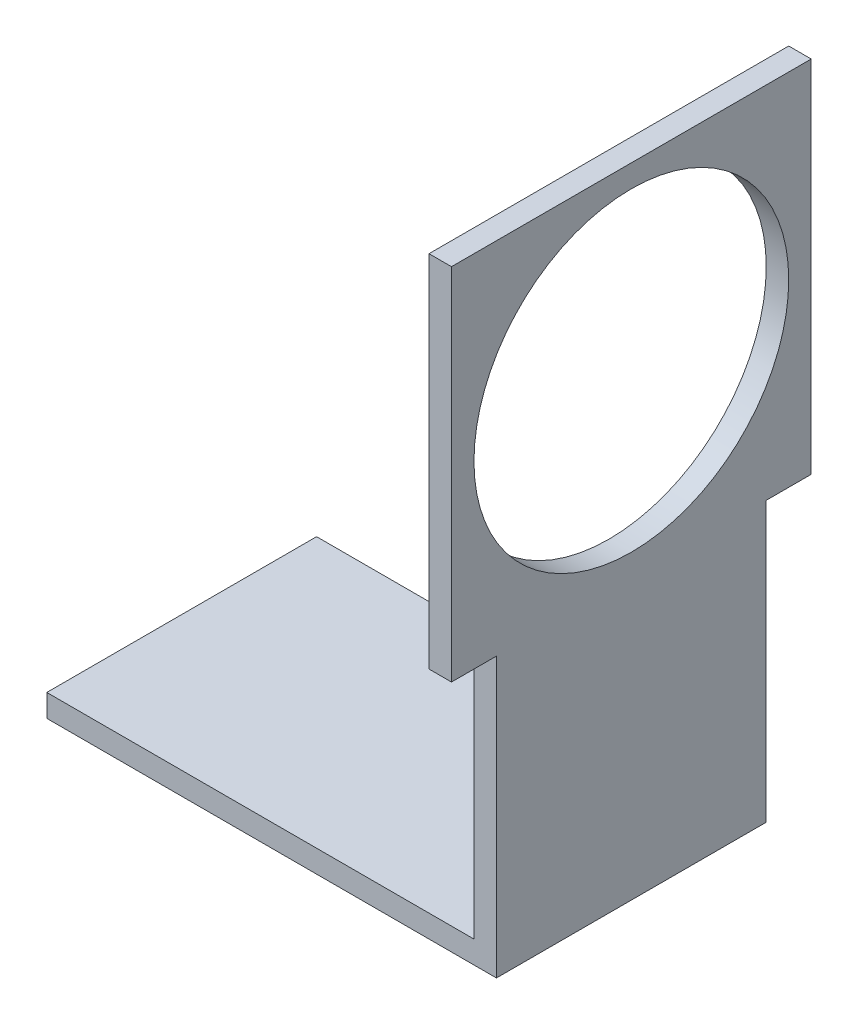
ISO-10303-21;
HEADER;
FILE_DESCRIPTION(('STEP AP214'),'2;1');
FILE_NAME('part.step','',(''),(''),'','','');
FILE_SCHEMA(('AUTOMOTIVE_DESIGN { 1 0 10303 214 1 1 1 1 }'));
ENDSEC;
DATA;
#1=APPLICATION_CONTEXT('core data for automotive mechanical design processes');
#2=APPLICATION_PROTOCOL_DEFINITION('international standard','automotive_design',2000,#1);
#3=PRODUCT_CONTEXT('',#1,'mechanical');
#4=PRODUCT('Part','Part','',(#3));
#5=PRODUCT_RELATED_PRODUCT_CATEGORY('part','',(#4));
#6=PRODUCT_DEFINITION_FORMATION('','',#4);
#7=PRODUCT_DEFINITION_CONTEXT('part definition',#1,'design');
#8=PRODUCT_DEFINITION('design','',#6,#7);
#9=PRODUCT_DEFINITION_SHAPE('','',#8);
#10=(LENGTH_UNIT() NAMED_UNIT(*) SI_UNIT(.MILLI.,.METRE.));
#11=(NAMED_UNIT(*) PLANE_ANGLE_UNIT() SI_UNIT($,.RADIAN.));
#12=(NAMED_UNIT(*) SI_UNIT($,.STERADIAN.) SOLID_ANGLE_UNIT());
#13=UNCERTAINTY_MEASURE_WITH_UNIT(LENGTH_MEASURE(1.E-05),#10,'distance_accuracy_value','');
#14=(GEOMETRIC_REPRESENTATION_CONTEXT(3) GLOBAL_UNCERTAINTY_ASSIGNED_CONTEXT((#13)) GLOBAL_UNIT_ASSIGNED_CONTEXT((#10,
#11,#12)) REPRESENTATION_CONTEXT('',''));
#15=CARTESIAN_POINT('',(0.,0.,0.));
#16=DIRECTION('',(0.,0.,1.));
#17=DIRECTION('',(1.,0.,0.));
#18=AXIS2_PLACEMENT_3D('',#15,#16,#17);
#19=CARTESIAN_POINT('',(-93.0573248407643,5.,-30.7643312101911));
#20=DIRECTION('',(1.,0.,0.));
#21=DIRECTION('',(0.,0.,-1.));
#22=AXIS2_PLACEMENT_3D('',#19,#20,#21);
#23=PLANE('',#22);
#24=DIRECTION('',(0.,0.,1.));
#25=VECTOR('',#24,1.);
#26=CARTESIAN_POINT('',(-93.0573248407643,0.,-30.7643312101911));
#27=LINE('',#26,#25);
#28=CARTESIAN_POINT('',(-93.0573248407643,0.,-30.7643312101911));
#29=VERTEX_POINT('',#28);
#30=CARTESIAN_POINT('',(-93.0573248407643,0.,29.2356687898089));
#31=VERTEX_POINT('',#30);
#32=EDGE_CURVE('E97',#29,#31,#27,.T.);
#33=ORIENTED_EDGE('',*,*,#32,.T.);
#34=DIRECTION('',(0.,-1.,0.));
#35=VECTOR('',#34,1.);
#36=CARTESIAN_POINT('',(-93.0573248407643,5.,29.2356687898089));
#37=LINE('',#36,#35);
#38=CARTESIAN_POINT('',(-93.0573248407643,5.,29.2356687898089));
#39=VERTEX_POINT('',#38);
#40=EDGE_CURVE('E11',#39,#31,#37,.T.);
#41=ORIENTED_EDGE('',*,*,#40,.F.);
#42=DIRECTION('',(0.,0.,1.));
#43=VECTOR('',#42,1.);
#44=CARTESIAN_POINT('',(-93.0573248407643,5.,-30.7643312101911));
#45=LINE('',#44,#43);
#46=CARTESIAN_POINT('',(-93.0573248407643,5.,-30.7643312101911));
#47=VERTEX_POINT('',#46);
#48=EDGE_CURVE('E91',#47,#39,#45,.T.);
#49=ORIENTED_EDGE('',*,*,#48,.F.);
#50=DIRECTION('',(0.,-1.,0.));
#51=VECTOR('',#50,1.);
#52=CARTESIAN_POINT('',(-93.0573248407643,5.,-30.7643312101911));
#53=LINE('',#52,#51);
#54=EDGE_CURVE('E82',#47,#29,#53,.T.);
#55=ORIENTED_EDGE('',*,*,#54,.T.);
#56=EDGE_LOOP('',(#33,#41,#49,#55));
#57=FACE_BOUND('',#56,.T.);
#58=ADVANCED_FACE('F39',(#57),#23,.F.);
#59=CARTESIAN_POINT('',(-93.0573248407643,5.,29.2356687898089));
#60=DIRECTION('',(0.,0.,-1.));
#61=DIRECTION('',(-1.,0.,0.));
#62=AXIS2_PLACEMENT_3D('',#59,#60,#61);
#63=PLANE('',#62);
#64=DIRECTION('',(1.,0.,0.));
#65=VECTOR('',#64,1.);
#66=CARTESIAN_POINT('',(-93.0573248407643,0.,29.2356687898089));
#67=LINE('',#66,#65);
#68=CARTESIAN_POINT('',(6.94267515923568,0.,29.2356687898089));
#69=VERTEX_POINT('',#68);
#70=EDGE_CURVE('E101',#31,#69,#67,.T.);
#71=ORIENTED_EDGE('',*,*,#70,.T.);
#72=DIRECTION('',(0.,-1.,0.));
#73=VECTOR('',#72,1.);
#74=CARTESIAN_POINT('',(6.94267515923568,5.,29.2356687898089));
#75=LINE('',#74,#73);
#76=CARTESIAN_POINT('',(6.94267515923568,62.,29.2356687898089));
#77=VERTEX_POINT('',#76);
#78=EDGE_CURVE('E47',#77,#69,#75,.T.);
#79=ORIENTED_EDGE('',*,*,#78,.F.);
#80=DIRECTION('',(1.,0.,0.));
#81=VECTOR('',#80,1.);
#82=CARTESIAN_POINT('',(6.94267515923566,62.,29.2356687898089));
#83=LINE('',#82,#81);
#84=CARTESIAN_POINT('',(1.94267515923567,62.,29.2356687898089));
#85=VERTEX_POINT('',#84);
#86=EDGE_CURVE('E132',#85,#77,#83,.T.);
#87=ORIENTED_EDGE('',*,*,#86,.F.);
#88=DIRECTION('',(0.,-1.,0.));
#89=VECTOR('',#88,1.);
#90=CARTESIAN_POINT('',(1.94267515923567,62.,29.2356687898089));
#91=LINE('',#90,#89);
#92=CARTESIAN_POINT('',(1.94267515923567,5.,29.2356687898089));
#93=VERTEX_POINT('',#92);
#94=EDGE_CURVE('E109',#85,#93,#91,.T.);
#95=ORIENTED_EDGE('',*,*,#94,.T.);
#96=DIRECTION('',(1.,0.,0.));
#97=VECTOR('',#96,1.);
#98=CARTESIAN_POINT('',(-93.0573248407643,5.,29.2356687898089));
#99=LINE('',#98,#97);
#100=EDGE_CURVE('E158',#39,#93,#99,.T.);
#101=ORIENTED_EDGE('',*,*,#100,.F.);
#102=ORIENTED_EDGE('',*,*,#40,.T.);
#103=EDGE_LOOP('',(#71,#79,#87,#95,#101,#102));
#104=FACE_BOUND('',#103,.T.);
#105=ADVANCED_FACE('F130',(#104),#63,.F.);
#106=CARTESIAN_POINT('',(6.94267515923566,5.,-30.7643312101911));
#107=DIRECTION('',(-1.,0.,0.));
#108=DIRECTION('',(0.,0.,1.));
#109=AXIS2_PLACEMENT_3D('',#106,#107,#108);
#110=PLANE('',#109);
#111=CARTESIAN_POINT('',(6.94267515923567,102.,-0.764331210191082));
#112=DIRECTION('',(1.,0.,0.));
#113=DIRECTION('',(0.,0.,-1.));
#114=AXIS2_PLACEMENT_3D('',#111,#112,#113);
#115=CIRCLE('',#114,35.);
#116=CARTESIAN_POINT('',(6.94267515923566,102.,-35.7643312101911));
#117=VERTEX_POINT('',#116);
#118=EDGE_CURVE('E193',#117,#117,#115,.T.);
#119=ORIENTED_EDGE('',*,*,#118,.F.);
#120=EDGE_LOOP('',(#119));
#121=FACE_BOUND('',#120,.T.);
#122=DIRECTION('',(0.,0.,-1.));
#123=VECTOR('',#122,1.);
#124=CARTESIAN_POINT('',(6.94267515923566,0.,-30.7643312101911));
#125=LINE('',#124,#123);
#126=CARTESIAN_POINT('',(6.94267515923566,0.,-30.7643312101911));
#127=VERTEX_POINT('',#126);
#128=EDGE_CURVE('E92',#69,#127,#125,.T.);
#129=ORIENTED_EDGE('',*,*,#128,.T.);
#130=DIRECTION('',(0.,-1.,0.));
#131=VECTOR('',#130,1.);
#132=CARTESIAN_POINT('',(6.94267515923566,5.,-30.7643312101911));
#133=LINE('',#132,#131);
#134=CARTESIAN_POINT('',(6.94267515923566,62.,-30.7643312101911));
#135=VERTEX_POINT('',#134);
#136=EDGE_CURVE('E86',#135,#127,#133,.T.);
#137=ORIENTED_EDGE('',*,*,#136,.F.);
#138=DIRECTION('',(0.,0.,-1.));
#139=VECTOR('',#138,1.);
#140=CARTESIAN_POINT('',(6.94267515923568,62.,29.2356687898089));
#141=LINE('',#140,#139);
#142=CARTESIAN_POINT('',(6.94267515923566,62.,-40.7643312101911));
#143=VERTEX_POINT('',#142);
#144=EDGE_CURVE('E180',#135,#143,#141,.T.);
#145=ORIENTED_EDGE('',*,*,#144,.T.);
#146=DIRECTION('',(0.,1.,0.));
#147=VECTOR('',#146,1.);
#148=CARTESIAN_POINT('',(6.94267515923566,62.,-40.7643312101911));
#149=LINE('',#148,#147);
#150=CARTESIAN_POINT('',(6.94267515923566,142.,-40.7643312101911));
#151=VERTEX_POINT('',#150);
#152=EDGE_CURVE('E191',#143,#151,#149,.T.);
#153=ORIENTED_EDGE('',*,*,#152,.T.);
#154=DIRECTION('',(0.,0.,1.));
#155=VECTOR('',#154,1.);
#156=CARTESIAN_POINT('',(6.94267515923566,142.,-40.7643312101911));
#157=LINE('',#156,#155);
#158=CARTESIAN_POINT('',(6.94267515923568,142.,39.2356687898089));
#159=VERTEX_POINT('',#158);
#160=EDGE_CURVE('E201',#151,#159,#157,.T.);
#161=ORIENTED_EDGE('',*,*,#160,.T.);
#162=DIRECTION('',(0.,-1.,0.));
#163=VECTOR('',#162,1.);
#164=CARTESIAN_POINT('',(6.94267515923568,142.,39.2356687898089));
#165=LINE('',#164,#163);
#166=CARTESIAN_POINT('',(6.94267515923568,62.,39.2356687898089));
#167=VERTEX_POINT('',#166);
#168=EDGE_CURVE('E205',#159,#167,#165,.T.);
#169=ORIENTED_EDGE('',*,*,#168,.T.);
#170=EDGE_CURVE('E126',#167,#77,#141,.T.);
#171=ORIENTED_EDGE('',*,*,#170,.T.);
#172=ORIENTED_EDGE('',*,*,#78,.T.);
#173=EDGE_LOOP('',(#129,#137,#145,#153,#161,#169,#171,#172));
#174=FACE_BOUND('',#173,.T.);
#175=ADVANCED_FACE('F122',(#121,#174),#110,.F.);
#176=CARTESIAN_POINT('',(-93.0573248407643,5.,-30.7643312101911));
#177=DIRECTION('',(0.,0.,1.));
#178=DIRECTION('',(1.,0.,0.));
#179=AXIS2_PLACEMENT_3D('',#176,#177,#178);
#180=PLANE('',#179);
#181=DIRECTION('',(-1.,0.,0.));
#182=VECTOR('',#181,1.);
#183=CARTESIAN_POINT('',(-93.0573248407643,0.,-30.7643312101911));
#184=LINE('',#183,#182);
#185=EDGE_CURVE('E79',#127,#29,#184,.T.);
#186=ORIENTED_EDGE('',*,*,#185,.T.);
#187=ORIENTED_EDGE('',*,*,#54,.F.);
#188=DIRECTION('',(-1.,0.,0.));
#189=VECTOR('',#188,1.);
#190=CARTESIAN_POINT('',(-93.0573248407643,5.,-30.7643312101911));
#191=LINE('',#190,#189);
#192=CARTESIAN_POINT('',(1.94267515923567,5.,-30.7643312101911));
#193=VERTEX_POINT('',#192);
#194=EDGE_CURVE('E59',#193,#47,#191,.T.);
#195=ORIENTED_EDGE('',*,*,#194,.F.);
#196=DIRECTION('',(0.,-1.,0.));
#197=VECTOR('',#196,1.);
#198=CARTESIAN_POINT('',(1.94267515923566,62.,-30.7643312101911));
#199=LINE('',#198,#197);
#200=CARTESIAN_POINT('',(1.94267515923566,62.,-30.7643312101911));
#201=VERTEX_POINT('',#200);
#202=EDGE_CURVE('E103',#201,#193,#199,.T.);
#203=ORIENTED_EDGE('',*,*,#202,.F.);
#204=DIRECTION('',(-1.,0.,0.));
#205=VECTOR('',#204,1.);
#206=CARTESIAN_POINT('',(6.94267515923566,62.,-30.7643312101911));
#207=LINE('',#206,#205);
#208=EDGE_CURVE('E145',#135,#201,#207,.T.);
#209=ORIENTED_EDGE('',*,*,#208,.F.);
#210=ORIENTED_EDGE('',*,*,#136,.T.);
#211=EDGE_LOOP('',(#186,#187,#195,#203,#209,#210));
#212=FACE_BOUND('',#211,.T.);
#213=ADVANCED_FACE('F81',(#212),#180,.F.);
#214=CARTESIAN_POINT('',(0.,5.,0.));
#215=DIRECTION('',(0.,1.,0.));
#216=DIRECTION('',(0.,0.,1.));
#217=AXIS2_PLACEMENT_3D('',#214,#215,#216);
#218=PLANE('',#217);
#219=DIRECTION('',(0.,0.,1.));
#220=VECTOR('',#219,1.);
#221=CARTESIAN_POINT('',(1.94267515923566,5.,-30.7643312101911));
#222=LINE('',#221,#220);
#223=EDGE_CURVE('E54',#193,#93,#222,.T.);
#224=ORIENTED_EDGE('',*,*,#223,.F.);
#225=ORIENTED_EDGE('',*,*,#194,.T.);
#226=ORIENTED_EDGE('',*,*,#48,.T.);
#227=ORIENTED_EDGE('',*,*,#100,.T.);
#228=EDGE_LOOP('',(#224,#225,#226,#227));
#229=FACE_BOUND('',#228,.T.);
#230=ADVANCED_FACE('F161',(#229),#218,.T.);
#231=CARTESIAN_POINT('',(0.,0.,0.));
#232=DIRECTION('',(0.,1.,0.));
#233=DIRECTION('',(0.,0.,1.));
#234=AXIS2_PLACEMENT_3D('',#231,#232,#233);
#235=PLANE('',#234);
#236=ORIENTED_EDGE('',*,*,#32,.F.);
#237=ORIENTED_EDGE('',*,*,#185,.F.);
#238=ORIENTED_EDGE('',*,*,#128,.F.);
#239=ORIENTED_EDGE('',*,*,#70,.F.);
#240=EDGE_LOOP('',(#236,#237,#238,#239));
#241=FACE_BOUND('',#240,.T.);
#242=ADVANCED_FACE('F100',(#241),#235,.F.);
#243=CARTESIAN_POINT('',(1.94267515923566,62.,-30.7643312101911));
#244=DIRECTION('',(1.,0.,0.));
#245=DIRECTION('',(0.,0.,-1.));
#246=AXIS2_PLACEMENT_3D('',#243,#244,#245);
#247=PLANE('',#246);
#248=CARTESIAN_POINT('',(1.94267515923567,102.,-0.76433121019108));
#249=DIRECTION('',(1.,0.,0.));
#250=DIRECTION('',(0.,0.,-1.));
#251=AXIS2_PLACEMENT_3D('',#248,#249,#250);
#252=CIRCLE('',#251,35.);
#253=CARTESIAN_POINT('',(1.94267515923566,102.,-35.7643312101911));
#254=VERTEX_POINT('',#253);
#255=EDGE_CURVE('E187',#254,#254,#252,.T.);
#256=ORIENTED_EDGE('',*,*,#255,.T.);
#257=EDGE_LOOP('',(#256));
#258=FACE_BOUND('',#257,.T.);
#259=ORIENTED_EDGE('',*,*,#223,.T.);
#260=ORIENTED_EDGE('',*,*,#94,.F.);
#261=DIRECTION('',(0.,0.,-1.));
#262=VECTOR('',#261,1.);
#263=CARTESIAN_POINT('',(1.94267515923568,62.,39.2356687898089));
#264=LINE('',#263,#262);
#265=CARTESIAN_POINT('',(1.94267515923568,62.,39.2356687898089));
#266=VERTEX_POINT('',#265);
#267=EDGE_CURVE('E143',#266,#85,#264,.T.);
#268=ORIENTED_EDGE('',*,*,#267,.F.);
#269=DIRECTION('',(0.,-1.,0.));
#270=VECTOR('',#269,1.);
#271=CARTESIAN_POINT('',(1.94267515923568,142.,39.2356687898089));
#272=LINE('',#271,#270);
#273=CARTESIAN_POINT('',(1.94267515923568,142.,39.2356687898089));
#274=VERTEX_POINT('',#273);
#275=EDGE_CURVE('E197',#274,#266,#272,.T.);
#276=ORIENTED_EDGE('',*,*,#275,.F.);
#277=DIRECTION('',(0.,0.,1.));
#278=VECTOR('',#277,1.);
#279=CARTESIAN_POINT('',(1.94267515923566,142.,-40.7643312101911));
#280=LINE('',#279,#278);
#281=CARTESIAN_POINT('',(1.94267515923566,142.,-40.7643312101911));
#282=VERTEX_POINT('',#281);
#283=EDGE_CURVE('E220',#282,#274,#280,.T.);
#284=ORIENTED_EDGE('',*,*,#283,.F.);
#285=DIRECTION('',(0.,1.,0.));
#286=VECTOR('',#285,1.);
#287=CARTESIAN_POINT('',(1.94267515923566,62.,-40.7643312101911));
#288=LINE('',#287,#286);
#289=CARTESIAN_POINT('',(1.94267515923566,62.,-40.7643312101911));
#290=VERTEX_POINT('',#289);
#291=EDGE_CURVE('E226',#290,#282,#288,.T.);
#292=ORIENTED_EDGE('',*,*,#291,.F.);
#293=EDGE_CURVE('E171',#201,#290,#264,.T.);
#294=ORIENTED_EDGE('',*,*,#293,.F.);
#295=ORIENTED_EDGE('',*,*,#202,.T.);
#296=EDGE_LOOP('',(#259,#260,#268,#276,#284,#292,#294,#295));
#297=FACE_BOUND('',#296,.T.);
#298=ADVANCED_FACE('F165',(#258,#297),#247,.F.);
#299=CARTESIAN_POINT('',(1.94267515923568,62.,29.2356687898089));
#300=DIRECTION('',(0.,-1.,0.));
#301=DIRECTION('',(0.,0.,-1.));
#302=AXIS2_PLACEMENT_3D('',#299,#300,#301);
#303=PLANE('',#302);
#304=ORIENTED_EDGE('',*,*,#144,.F.);
#305=ORIENTED_EDGE('',*,*,#208,.T.);
#306=ORIENTED_EDGE('',*,*,#293,.T.);
#307=DIRECTION('',(1.,0.,0.));
#308=VECTOR('',#307,1.);
#309=CARTESIAN_POINT('',(1.94267515923566,62.,-40.7643312101911));
#310=LINE('',#309,#308);
#311=EDGE_CURVE('E182',#290,#143,#310,.T.);
#312=ORIENTED_EDGE('',*,*,#311,.T.);
#313=EDGE_LOOP('',(#304,#305,#306,#312));
#314=FACE_BOUND('',#313,.T.);
#315=ADVANCED_FACE('F175',(#314),#303,.T.);
#316=CARTESIAN_POINT('',(1.94267515923568,142.,39.2356687898089));
#317=DIRECTION('',(0.,0.,1.));
#318=DIRECTION('',(1.,0.,0.));
#319=AXIS2_PLACEMENT_3D('',#316,#317,#318);
#320=PLANE('',#319);
#321=ORIENTED_EDGE('',*,*,#168,.F.);
#322=DIRECTION('',(1.,0.,0.));
#323=VECTOR('',#322,1.);
#324=CARTESIAN_POINT('',(1.94267515923568,142.,39.2356687898089));
#325=LINE('',#324,#323);
#326=EDGE_CURVE('E210',#274,#159,#325,.T.);
#327=ORIENTED_EDGE('',*,*,#326,.F.);
#328=ORIENTED_EDGE('',*,*,#275,.T.);
#329=DIRECTION('',(1.,0.,0.));
#330=VECTOR('',#329,1.);
#331=CARTESIAN_POINT('',(1.94267515923568,62.,39.2356687898089));
#332=LINE('',#331,#330);
#333=EDGE_CURVE('E155',#266,#167,#332,.T.);
#334=ORIENTED_EDGE('',*,*,#333,.T.);
#335=EDGE_LOOP('',(#321,#327,#328,#334));
#336=FACE_BOUND('',#335,.T.);
#337=ADVANCED_FACE('F282',(#336),#320,.T.);
#338=CARTESIAN_POINT('',(1.94267515923566,142.,-40.7643312101911));
#339=DIRECTION('',(0.,1.,0.));
#340=DIRECTION('',(0.,0.,1.));
#341=AXIS2_PLACEMENT_3D('',#338,#339,#340);
#342=PLANE('',#341);
#343=ORIENTED_EDGE('',*,*,#160,.F.);
#344=DIRECTION('',(1.,0.,0.));
#345=VECTOR('',#344,1.);
#346=CARTESIAN_POINT('',(1.94267515923566,142.,-40.7643312101911));
#347=LINE('',#346,#345);
#348=EDGE_CURVE('E214',#282,#151,#347,.T.);
#349=ORIENTED_EDGE('',*,*,#348,.F.);
#350=ORIENTED_EDGE('',*,*,#283,.T.);
#351=ORIENTED_EDGE('',*,*,#326,.T.);
#352=EDGE_LOOP('',(#343,#349,#350,#351));
#353=FACE_BOUND('',#352,.T.);
#354=ADVANCED_FACE('F293',(#353),#342,.T.);
#355=CARTESIAN_POINT('',(1.94267515923566,62.,-40.7643312101911));
#356=DIRECTION('',(0.,0.,-1.));
#357=DIRECTION('',(-1.,0.,0.));
#358=AXIS2_PLACEMENT_3D('',#355,#356,#357);
#359=PLANE('',#358);
#360=ORIENTED_EDGE('',*,*,#152,.F.);
#361=ORIENTED_EDGE('',*,*,#311,.F.);
#362=ORIENTED_EDGE('',*,*,#291,.T.);
#363=ORIENTED_EDGE('',*,*,#348,.T.);
#364=EDGE_LOOP('',(#360,#361,#362,#363));
#365=FACE_BOUND('',#364,.T.);
#366=ADVANCED_FACE('F302',(#365),#359,.T.);
#367=ORIENTED_EDGE('',*,*,#267,.T.);
#368=ORIENTED_EDGE('',*,*,#86,.T.);
#369=ORIENTED_EDGE('',*,*,#170,.F.);
#370=ORIENTED_EDGE('',*,*,#333,.F.);
#371=EDGE_LOOP('',(#367,#368,#369,#370));
#372=FACE_BOUND('',#371,.T.);
#373=ADVANCED_FACE('F138',(#372),#303,.T.);
#374=CARTESIAN_POINT('',(1.94267515923567,102.,-0.76433121019108));
#375=DIRECTION('',(1.,0.,0.));
#376=DIRECTION('',(0.,0.,-1.));
#377=AXIS2_PLACEMENT_3D('',#374,#375,#376);
#378=CYLINDRICAL_SURFACE('',#377,35.);
#379=ORIENTED_EDGE('',*,*,#255,.F.);
#380=EDGE_LOOP('',(#379));
#381=FACE_BOUND('',#380,.T.);
#382=ORIENTED_EDGE('',*,*,#118,.T.);
#383=EDGE_LOOP('',(#382));
#384=FACE_BOUND('',#383,.T.);
#385=ADVANCED_FACE('F241',(#381,#384),#378,.F.);
#386=CLOSED_SHELL('',(#58,#105,#175,#213,#230,#242,#298,#315,#337,#354,#366,#373,#385));
#387=MANIFOLD_SOLID_BREP('B2',#386);
#388=ADVANCED_BREP_SHAPE_REPRESENTATION('',(#18,#387),#14);
#389=SHAPE_DEFINITION_REPRESENTATION(#9,#388);
ENDSEC;
END-ISO-10303-21;
